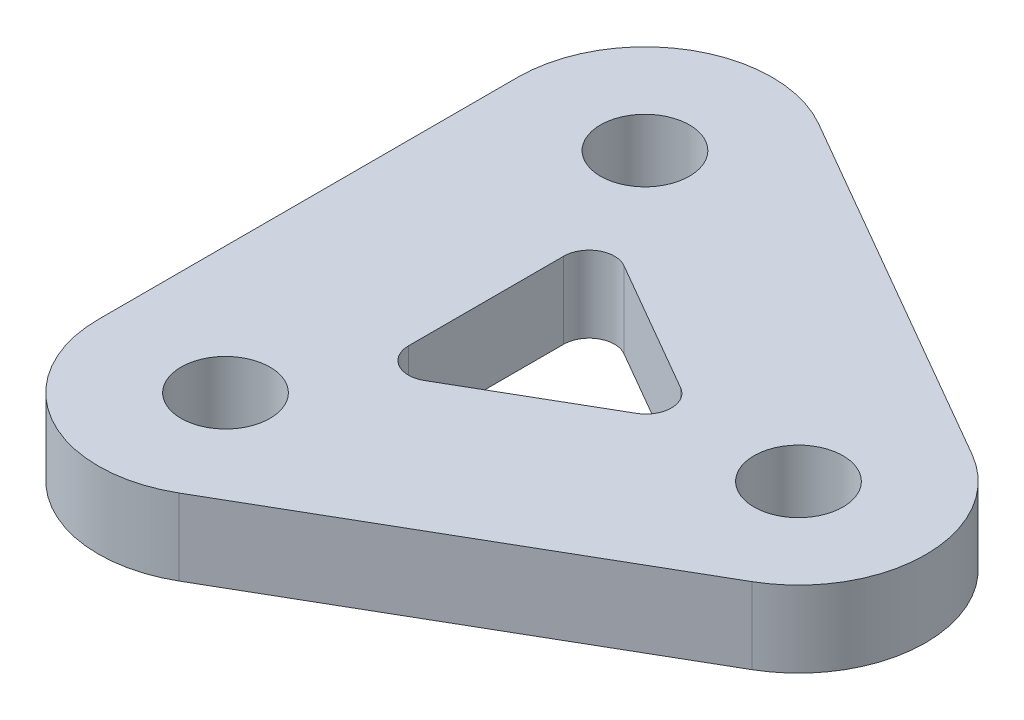
ISO-10303-21;
HEADER;
FILE_DESCRIPTION(('STEP AP214'),'2;1');
FILE_NAME('part.step','',(''),(''),'','','');
FILE_SCHEMA(('AUTOMOTIVE_DESIGN { 1 0 10303 214 1 1 1 1 }'));
ENDSEC;
DATA;
#1=APPLICATION_CONTEXT('core data for automotive mechanical design processes');
#2=APPLICATION_PROTOCOL_DEFINITION('international standard','automotive_design',2000,#1);
#3=PRODUCT_CONTEXT('',#1,'mechanical');
#4=PRODUCT('Part','Part','',(#3));
#5=PRODUCT_RELATED_PRODUCT_CATEGORY('part','',(#4));
#6=PRODUCT_DEFINITION_FORMATION('','',#4);
#7=PRODUCT_DEFINITION_CONTEXT('part definition',#1,'design');
#8=PRODUCT_DEFINITION('design','',#6,#7);
#9=PRODUCT_DEFINITION_SHAPE('','',#8);
#10=(LENGTH_UNIT() NAMED_UNIT(*) SI_UNIT(.MILLI.,.METRE.));
#11=(NAMED_UNIT(*) PLANE_ANGLE_UNIT() SI_UNIT($,.RADIAN.));
#12=(NAMED_UNIT(*) SI_UNIT($,.STERADIAN.) SOLID_ANGLE_UNIT());
#13=UNCERTAINTY_MEASURE_WITH_UNIT(LENGTH_MEASURE(1.E-05),#10,'distance_accuracy_value','');
#14=(GEOMETRIC_REPRESENTATION_CONTEXT(3) GLOBAL_UNCERTAINTY_ASSIGNED_CONTEXT((#13)) GLOBAL_UNIT_ASSIGNED_CONTEXT((#10,
#11,#12)) REPRESENTATION_CONTEXT('',''));
#15=CARTESIAN_POINT('',(0.,0.,0.));
#16=DIRECTION('',(0.,0.,1.));
#17=DIRECTION('',(1.,0.,0.));
#18=AXIS2_PLACEMENT_3D('',#15,#16,#17);
#19=CARTESIAN_POINT('',(-7.14470958122166,3.,-8.25000000000011));
#20=DIRECTION('',(0.,1.,0.));
#21=DIRECTION('',(0.,0.,1.));
#22=AXIS2_PLACEMENT_3D('',#19,#20,#21);
#23=PLANE('',#22);
#24=CARTESIAN_POINT('',(-7.14470958122166,3.,8.25000000000007));
#25=DIRECTION('',(0.,1.,0.));
#26=DIRECTION('',(0.,0.,1.));
#27=AXIS2_PLACEMENT_3D('',#24,#25,#26);
#28=CIRCLE('',#27,1.75);
#29=CARTESIAN_POINT('',(-7.14470958122166,3.,10.0000000000001));
#30=VERTEX_POINT('',#29);
#31=EDGE_CURVE('E181',#30,#30,#28,.T.);
#32=ORIENTED_EDGE('',*,*,#31,.F.);
#33=EDGE_LOOP('',(#32));
#34=FACE_BOUND('',#33,.T.);
#35=CARTESIAN_POINT('',(-7.14470958122166,3.,-8.25000000000011));
#36=DIRECTION('',(0.,1.,0.));
#37=DIRECTION('',(0.,0.,1.));
#38=AXIS2_PLACEMENT_3D('',#35,#36,#37);
#39=CIRCLE('',#38,5.);
#40=CARTESIAN_POINT('',(-4.6447095812216,3.,-12.5801270189223));
#41=VERTEX_POINT('',#40);
#42=CARTESIAN_POINT('',(-12.1447095812217,3.,-8.25000000000005));
#43=VERTEX_POINT('',#42);
#44=EDGE_CURVE('E193',#41,#43,#39,.T.);
#45=ORIENTED_EDGE('',*,*,#44,.T.);
#46=DIRECTION('',(0.,0.,1.));
#47=VECTOR('',#46,1.);
#48=CARTESIAN_POINT('',(-12.1447095812217,3.,-8.25000000000005));
#49=LINE('',#48,#47);
#50=CARTESIAN_POINT('',(-12.1447095812217,3.,8.25));
#51=VERTEX_POINT('',#50);
#52=EDGE_CURVE('E196',#43,#51,#49,.T.);
#53=ORIENTED_EDGE('',*,*,#52,.T.);
#54=CARTESIAN_POINT('',(-7.14470958122166,3.,8.25000000000007));
#55=DIRECTION('',(0.,1.,0.));
#56=DIRECTION('',(0.,0.,-1.));
#57=AXIS2_PLACEMENT_3D('',#54,#55,#56);
#58=CIRCLE('',#57,5.);
#59=CARTESIAN_POINT('',(-4.6447095812216,3.,12.5801270189222));
#60=VERTEX_POINT('',#59);
#61=EDGE_CURVE('E199',#51,#60,#58,.T.);
#62=ORIENTED_EDGE('',*,*,#61,.T.);
#63=DIRECTION('',(0.866025403784439,0.,-0.5));
#64=VECTOR('',#63,1.);
#65=CARTESIAN_POINT('',(-4.6447095812216,3.,12.5801270189222));
#66=LINE('',#65,#64);
#67=CARTESIAN_POINT('',(9.64470958122168,3.,4.3301270189222));
#68=VERTEX_POINT('',#67);
#69=EDGE_CURVE('E201',#60,#68,#66,.T.);
#70=ORIENTED_EDGE('',*,*,#69,.T.);
#71=CARTESIAN_POINT('',(7.14470958122174,3.,0.));
#72=DIRECTION('',(0.,1.,0.));
#73=DIRECTION('',(0.,0.,1.));
#74=AXIS2_PLACEMENT_3D('',#71,#72,#73);
#75=CIRCLE('',#74,5.);
#76=CARTESIAN_POINT('',(9.64470958122168,3.,-4.33012701892225));
#77=VERTEX_POINT('',#76);
#78=EDGE_CURVE('E203',#68,#77,#75,.T.);
#79=ORIENTED_EDGE('',*,*,#78,.T.);
#80=DIRECTION('',(-0.866025403784439,0.,-0.5));
#81=VECTOR('',#80,1.);
#82=CARTESIAN_POINT('',(9.64470958122168,3.,-4.33012701892225));
#83=LINE('',#82,#81);
#84=EDGE_CURVE('E205',#77,#41,#83,.T.);
#85=ORIENTED_EDGE('',*,*,#84,.T.);
#86=EDGE_LOOP('',(#45,#53,#62,#70,#79,#85));
#87=FACE_BOUND('',#86,.T.);
#88=CARTESIAN_POINT('',(7.14470958122166,3.,0.));
#89=DIRECTION('',(0.,1.,0.));
#90=DIRECTION('',(0.,0.,1.));
#91=AXIS2_PLACEMENT_3D('',#88,#89,#90);
#92=CIRCLE('',#91,1.75);
#93=CARTESIAN_POINT('',(7.14470958122166,3.,1.74999999999993));
#94=VERTEX_POINT('',#93);
#95=EDGE_CURVE('E187',#94,#94,#92,.T.);
#96=ORIENTED_EDGE('',*,*,#95,.F.);
#97=EDGE_LOOP('',(#96));
#98=FACE_BOUND('',#97,.T.);
#99=CARTESIAN_POINT('',(-7.14470958122166,3.,-8.24999999999993));
#100=DIRECTION('',(0.,1.,0.));
#101=DIRECTION('',(0.,0.,1.));
#102=AXIS2_PLACEMENT_3D('',#99,#100,#101);
#103=CIRCLE('',#102,1.75);
#104=CARTESIAN_POINT('',(-7.14470958122166,3.,-6.49999999999993));
#105=VERTEX_POINT('',#104);
#106=EDGE_CURVE('E175',#105,#105,#103,.T.);
#107=ORIENTED_EDGE('',*,*,#106,.F.);
#108=EDGE_LOOP('',(#107));
#109=FACE_BOUND('',#108,.T.);
#110=DIRECTION('',(-0.866025403784443,0.,-0.499999999999992));
#111=VECTOR('',#110,1.);
#112=CARTESIAN_POINT('',(1.64470958122163,3.,-0.866025403784468));
#113=LINE('',#112,#111);
#114=CARTESIAN_POINT('',(1.64470958122163,3.,-0.866025403784468));
#115=VERTEX_POINT('',#114);
#116=CARTESIAN_POINT('',(-3.64470958122167,3.,-3.9198729810778));
#117=VERTEX_POINT('',#116);
#118=EDGE_CURVE('E132',#115,#117,#113,.T.);
#119=ORIENTED_EDGE('',*,*,#118,.F.);
#120=CARTESIAN_POINT('',(1.14470958122164,3.,0.));
#121=DIRECTION('',(0.,1.,0.));
#122=DIRECTION('',(0.,0.,1.));
#123=AXIS2_PLACEMENT_3D('',#120,#121,#122);
#124=CIRCLE('',#123,1.);
#125=CARTESIAN_POINT('',(1.64470958122164,3.,0.866025403784412));
#126=VERTEX_POINT('',#125);
#127=EDGE_CURVE('E124',#126,#115,#124,.T.);
#128=ORIENTED_EDGE('',*,*,#127,.F.);
#129=DIRECTION('',(0.866025403784436,0.,-0.500000000000004));
#130=VECTOR('',#129,1.);
#131=CARTESIAN_POINT('',(-3.64470958122166,3.,3.91987298107785));
#132=LINE('',#131,#130);
#133=CARTESIAN_POINT('',(-3.64470958122166,3.,3.91987298107784));
#134=VERTEX_POINT('',#133);
#135=EDGE_CURVE('E153',#134,#126,#132,.T.);
#136=ORIENTED_EDGE('',*,*,#135,.F.);
#137=CARTESIAN_POINT('',(-4.14470958122166,3.,3.05384757729341));
#138=DIRECTION('',(0.,1.,0.));
#139=DIRECTION('',(0.,0.,1.));
#140=AXIS2_PLACEMENT_3D('',#137,#138,#139);
#141=CIRCLE('',#140,1.);
#142=CARTESIAN_POINT('',(-5.14470958122166,3.,3.05384757729341));
#143=VERTEX_POINT('',#142);
#144=EDGE_CURVE('E151',#143,#134,#141,.T.);
#145=ORIENTED_EDGE('',*,*,#144,.F.);
#146=DIRECTION('',(0.,0.,1.));
#147=VECTOR('',#146,1.);
#148=CARTESIAN_POINT('',(-5.14470958122166,3.,-3.05384757729336));
#149=LINE('',#148,#147);
#150=CARTESIAN_POINT('',(-5.14470958122166,3.,-3.05384757729336));
#151=VERTEX_POINT('',#150);
#152=EDGE_CURVE('E147',#151,#143,#149,.T.);
#153=ORIENTED_EDGE('',*,*,#152,.F.);
#154=CARTESIAN_POINT('',(-4.14470958122166,3.,-3.05384757729336));
#155=DIRECTION('',(0.,1.,0.));
#156=DIRECTION('',(0.,0.,-1.));
#157=AXIS2_PLACEMENT_3D('',#154,#155,#156);
#158=CIRCLE('',#157,1.);
#159=EDGE_CURVE('E145',#117,#151,#158,.T.);
#160=ORIENTED_EDGE('',*,*,#159,.F.);
#161=EDGE_LOOP('',(#119,#128,#136,#145,#153,#160));
#162=FACE_BOUND('',#161,.T.);
#163=ADVANCED_FACE('F35',(#34,#87,#98,#109,#162),#23,.T.);
#164=CARTESIAN_POINT('',(-7.14470958122166,0.,-8.25000000000011));
#165=DIRECTION('',(0.,1.,0.));
#166=DIRECTION('',(0.,0.,1.));
#167=AXIS2_PLACEMENT_3D('',#164,#165,#166);
#168=PLANE('',#167);
#169=CARTESIAN_POINT('',(-7.14470958122166,0.,-8.24999999999993));
#170=DIRECTION('',(0.,1.,0.));
#171=DIRECTION('',(0.,0.,1.));
#172=AXIS2_PLACEMENT_3D('',#169,#170,#171);
#173=CIRCLE('',#172,1.75);
#174=CARTESIAN_POINT('',(-7.14470958122166,0.,-6.49999999999993));
#175=VERTEX_POINT('',#174);
#176=EDGE_CURVE('E140',#175,#175,#173,.T.);
#177=ORIENTED_EDGE('',*,*,#176,.T.);
#178=EDGE_LOOP('',(#177));
#179=FACE_BOUND('',#178,.T.);
#180=CARTESIAN_POINT('',(-7.14470958122166,0.,8.25000000000007));
#181=DIRECTION('',(0.,1.,0.));
#182=DIRECTION('',(0.,0.,1.));
#183=AXIS2_PLACEMENT_3D('',#180,#181,#182);
#184=CIRCLE('',#183,1.75);
#185=CARTESIAN_POINT('',(-7.14470958122166,0.,10.0000000000001));
#186=VERTEX_POINT('',#185);
#187=EDGE_CURVE('E178',#186,#186,#184,.T.);
#188=ORIENTED_EDGE('',*,*,#187,.T.);
#189=EDGE_LOOP('',(#188));
#190=FACE_BOUND('',#189,.T.);
#191=CARTESIAN_POINT('',(7.14470958122166,0.,0.));
#192=DIRECTION('',(0.,1.,0.));
#193=DIRECTION('',(0.,0.,1.));
#194=AXIS2_PLACEMENT_3D('',#191,#192,#193);
#195=CIRCLE('',#194,1.75);
#196=CARTESIAN_POINT('',(7.14470958122166,0.,1.74999999999993));
#197=VERTEX_POINT('',#196);
#198=EDGE_CURVE('E184',#197,#197,#195,.T.);
#199=ORIENTED_EDGE('',*,*,#198,.T.);
#200=EDGE_LOOP('',(#199));
#201=FACE_BOUND('',#200,.T.);
#202=CARTESIAN_POINT('',(-7.14470958122166,0.,-8.25000000000011));
#203=DIRECTION('',(0.,1.,0.));
#204=DIRECTION('',(0.,0.,1.));
#205=AXIS2_PLACEMENT_3D('',#202,#203,#204);
#206=CIRCLE('',#205,5.);
#207=CARTESIAN_POINT('',(-4.6447095812216,0.,-12.5801270189223));
#208=VERTEX_POINT('',#207);
#209=CARTESIAN_POINT('',(-12.1447095812217,0.,-8.25000000000005));
#210=VERTEX_POINT('',#209);
#211=EDGE_CURVE('E190',#208,#210,#206,.T.);
#212=ORIENTED_EDGE('',*,*,#211,.F.);
#213=DIRECTION('',(-0.866025403784439,0.,-0.5));
#214=VECTOR('',#213,1.);
#215=CARTESIAN_POINT('',(9.64470958122168,0.,-4.33012701892225));
#216=LINE('',#215,#214);
#217=CARTESIAN_POINT('',(9.64470958122168,0.,-4.33012701892225));
#218=VERTEX_POINT('',#217);
#219=EDGE_CURVE('E197',#218,#208,#216,.T.);
#220=ORIENTED_EDGE('',*,*,#219,.F.);
#221=CARTESIAN_POINT('',(7.14470958122174,0.,0.));
#222=DIRECTION('',(0.,1.,0.));
#223=DIRECTION('',(0.,0.,1.));
#224=AXIS2_PLACEMENT_3D('',#221,#222,#223);
#225=CIRCLE('',#224,5.);
#226=CARTESIAN_POINT('',(9.64470958122168,0.,4.3301270189222));
#227=VERTEX_POINT('',#226);
#228=EDGE_CURVE('E216',#227,#218,#225,.T.);
#229=ORIENTED_EDGE('',*,*,#228,.F.);
#230=DIRECTION('',(0.866025403784439,0.,-0.5));
#231=VECTOR('',#230,1.);
#232=CARTESIAN_POINT('',(-4.6447095812216,0.,12.5801270189222));
#233=LINE('',#232,#231);
#234=CARTESIAN_POINT('',(-4.6447095812216,0.,12.5801270189222));
#235=VERTEX_POINT('',#234);
#236=EDGE_CURVE('E214',#235,#227,#233,.T.);
#237=ORIENTED_EDGE('',*,*,#236,.F.);
#238=CARTESIAN_POINT('',(-7.14470958122166,0.,8.25000000000007));
#239=DIRECTION('',(0.,1.,0.));
#240=DIRECTION('',(0.,0.,-1.));
#241=AXIS2_PLACEMENT_3D('',#238,#239,#240);
#242=CIRCLE('',#241,5.);
#243=CARTESIAN_POINT('',(-12.1447095812217,0.,8.25));
#244=VERTEX_POINT('',#243);
#245=EDGE_CURVE('E212',#244,#235,#242,.T.);
#246=ORIENTED_EDGE('',*,*,#245,.F.);
#247=DIRECTION('',(0.,0.,1.));
#248=VECTOR('',#247,1.);
#249=CARTESIAN_POINT('',(-12.1447095812217,0.,-8.25000000000005));
#250=LINE('',#249,#248);
#251=EDGE_CURVE('E210',#210,#244,#250,.T.);
#252=ORIENTED_EDGE('',*,*,#251,.F.);
#253=EDGE_LOOP('',(#212,#220,#229,#237,#246,#252));
#254=FACE_BOUND('',#253,.T.);
#255=CARTESIAN_POINT('',(1.14470958122164,0.,0.));
#256=DIRECTION('',(0.,1.,0.));
#257=DIRECTION('',(0.,0.,1.));
#258=AXIS2_PLACEMENT_3D('',#255,#256,#257);
#259=CIRCLE('',#258,1.);
#260=CARTESIAN_POINT('',(1.64470958122164,0.,0.866025403784408));
#261=VERTEX_POINT('',#260);
#262=CARTESIAN_POINT('',(1.64470958122163,0.,-0.866025403784468));
#263=VERTEX_POINT('',#262);
#264=EDGE_CURVE('E58',#261,#263,#259,.T.);
#265=ORIENTED_EDGE('',*,*,#264,.T.);
#266=DIRECTION('',(-0.866025403784443,0.,-0.499999999999992));
#267=VECTOR('',#266,1.);
#268=CARTESIAN_POINT('',(1.64470958122163,0.,-0.866025403784468));
#269=LINE('',#268,#267);
#270=CARTESIAN_POINT('',(-3.64470958122167,0.,-3.9198729810778));
#271=VERTEX_POINT('',#270);
#272=EDGE_CURVE('E139',#263,#271,#269,.T.);
#273=ORIENTED_EDGE('',*,*,#272,.T.);
#274=CARTESIAN_POINT('',(-4.14470958122166,0.,-3.05384757729336));
#275=DIRECTION('',(0.,1.,0.));
#276=DIRECTION('',(0.,0.,-1.));
#277=AXIS2_PLACEMENT_3D('',#274,#275,#276);
#278=CIRCLE('',#277,1.);
#279=CARTESIAN_POINT('',(-5.14470958122166,0.,-3.05384757729336));
#280=VERTEX_POINT('',#279);
#281=EDGE_CURVE('E157',#271,#280,#278,.T.);
#282=ORIENTED_EDGE('',*,*,#281,.T.);
#283=DIRECTION('',(0.,0.,1.));
#284=VECTOR('',#283,1.);
#285=CARTESIAN_POINT('',(-5.14470958122166,0.,-3.05384757729336));
#286=LINE('',#285,#284);
#287=CARTESIAN_POINT('',(-5.14470958122166,0.,3.05384757729341));
#288=VERTEX_POINT('',#287);
#289=EDGE_CURVE('E160',#280,#288,#286,.T.);
#290=ORIENTED_EDGE('',*,*,#289,.T.);
#291=CARTESIAN_POINT('',(-4.14470958122166,0.,3.05384757729341));
#292=DIRECTION('',(0.,1.,0.));
#293=DIRECTION('',(0.,0.,1.));
#294=AXIS2_PLACEMENT_3D('',#291,#292,#293);
#295=CIRCLE('',#294,1.);
#296=CARTESIAN_POINT('',(-3.64470958122166,0.,3.91987298107785));
#297=VERTEX_POINT('',#296);
#298=EDGE_CURVE('E163',#288,#297,#295,.T.);
#299=ORIENTED_EDGE('',*,*,#298,.T.);
#300=DIRECTION('',(0.866025403784436,0.,-0.500000000000004));
#301=VECTOR('',#300,1.);
#302=CARTESIAN_POINT('',(-3.64470958122166,0.,3.91987298107785));
#303=LINE('',#302,#301);
#304=EDGE_CURVE('E133',#297,#261,#303,.T.);
#305=ORIENTED_EDGE('',*,*,#304,.T.);
#306=EDGE_LOOP('',(#265,#273,#282,#290,#299,#305));
#307=FACE_BOUND('',#306,.T.);
#308=ADVANCED_FACE('F240',(#179,#190,#201,#254,#307),#168,.F.);
#309=CARTESIAN_POINT('',(-7.14470958122166,3.,-8.25000000000011));
#310=DIRECTION('',(0.,-1.,0.));
#311=DIRECTION('',(0.,0.,-1.));
#312=AXIS2_PLACEMENT_3D('',#309,#310,#311);
#313=CYLINDRICAL_SURFACE('',#312,5.);
#314=ORIENTED_EDGE('',*,*,#211,.T.);
#315=DIRECTION('',(0.,-1.,0.));
#316=VECTOR('',#315,1.);
#317=CARTESIAN_POINT('',(-12.1447095812217,3.,-8.25000000000005));
#318=LINE('',#317,#316);
#319=EDGE_CURVE('E11',#43,#210,#318,.T.);
#320=ORIENTED_EDGE('',*,*,#319,.F.);
#321=ORIENTED_EDGE('',*,*,#44,.F.);
#322=DIRECTION('',(0.,-1.,0.));
#323=VECTOR('',#322,1.);
#324=CARTESIAN_POINT('',(-4.6447095812216,3.,-12.5801270189223));
#325=LINE('',#324,#323);
#326=EDGE_CURVE('E207',#41,#208,#325,.T.);
#327=ORIENTED_EDGE('',*,*,#326,.T.);
#328=EDGE_LOOP('',(#314,#320,#321,#327));
#329=FACE_BOUND('',#328,.T.);
#330=ADVANCED_FACE('F37',(#329),#313,.T.);
#331=CARTESIAN_POINT('',(-12.1447095812217,3.,-8.25000000000005));
#332=DIRECTION('',(1.,0.,0.));
#333=DIRECTION('',(0.,0.,-1.));
#334=AXIS2_PLACEMENT_3D('',#331,#332,#333);
#335=PLANE('',#334);
#336=ORIENTED_EDGE('',*,*,#251,.T.);
#337=DIRECTION('',(0.,-1.,0.));
#338=VECTOR('',#337,1.);
#339=CARTESIAN_POINT('',(-12.1447095812217,3.,8.25));
#340=LINE('',#339,#338);
#341=EDGE_CURVE('E43',#51,#244,#340,.T.);
#342=ORIENTED_EDGE('',*,*,#341,.F.);
#343=ORIENTED_EDGE('',*,*,#52,.F.);
#344=ORIENTED_EDGE('',*,*,#319,.T.);
#345=EDGE_LOOP('',(#336,#342,#343,#344));
#346=FACE_BOUND('',#345,.T.);
#347=ADVANCED_FACE('F258',(#346),#335,.F.);
#348=CARTESIAN_POINT('',(-7.14470958122166,3.,8.25000000000007));
#349=DIRECTION('',(0.,-1.,0.));
#350=DIRECTION('',(0.,0.,-1.));
#351=AXIS2_PLACEMENT_3D('',#348,#349,#350);
#352=CYLINDRICAL_SURFACE('',#351,5.);
#353=ORIENTED_EDGE('',*,*,#245,.T.);
#354=DIRECTION('',(0.,-1.,0.));
#355=VECTOR('',#354,1.);
#356=CARTESIAN_POINT('',(-4.6447095812216,3.,12.5801270189222));
#357=LINE('',#356,#355);
#358=EDGE_CURVE('E227',#60,#235,#357,.T.);
#359=ORIENTED_EDGE('',*,*,#358,.F.);
#360=ORIENTED_EDGE('',*,*,#61,.F.);
#361=ORIENTED_EDGE('',*,*,#341,.T.);
#362=EDGE_LOOP('',(#353,#359,#360,#361));
#363=FACE_BOUND('',#362,.T.);
#364=ADVANCED_FACE('F234',(#363),#352,.T.);
#365=CARTESIAN_POINT('',(-4.6447095812216,3.,12.5801270189222));
#366=DIRECTION('',(-0.5,0.,-0.866025403784438));
#367=DIRECTION('',(-0.866025403784439,0.,0.5));
#368=AXIS2_PLACEMENT_3D('',#365,#366,#367);
#369=PLANE('',#368);
#370=ORIENTED_EDGE('',*,*,#236,.T.);
#371=DIRECTION('',(0.,-1.,0.));
#372=VECTOR('',#371,1.);
#373=CARTESIAN_POINT('',(9.64470958122168,3.,4.3301270189222));
#374=LINE('',#373,#372);
#375=EDGE_CURVE('E224',#68,#227,#374,.T.);
#376=ORIENTED_EDGE('',*,*,#375,.F.);
#377=ORIENTED_EDGE('',*,*,#69,.F.);
#378=ORIENTED_EDGE('',*,*,#358,.T.);
#379=EDGE_LOOP('',(#370,#376,#377,#378));
#380=FACE_BOUND('',#379,.T.);
#381=ADVANCED_FACE('F246',(#380),#369,.F.);
#382=CARTESIAN_POINT('',(7.14470958122174,3.,0.));
#383=DIRECTION('',(0.,-1.,0.));
#384=DIRECTION('',(0.,0.,-1.));
#385=AXIS2_PLACEMENT_3D('',#382,#383,#384);
#386=CYLINDRICAL_SURFACE('',#385,5.);
#387=ORIENTED_EDGE('',*,*,#228,.T.);
#388=DIRECTION('',(0.,-1.,0.));
#389=VECTOR('',#388,1.);
#390=CARTESIAN_POINT('',(9.64470958122168,3.,-4.33012701892225));
#391=LINE('',#390,#389);
#392=EDGE_CURVE('E221',#77,#218,#391,.T.);
#393=ORIENTED_EDGE('',*,*,#392,.F.);
#394=ORIENTED_EDGE('',*,*,#78,.F.);
#395=ORIENTED_EDGE('',*,*,#375,.T.);
#396=EDGE_LOOP('',(#387,#393,#394,#395));
#397=FACE_BOUND('',#396,.T.);
#398=ADVANCED_FACE('F250',(#397),#386,.T.);
#399=CARTESIAN_POINT('',(9.64470958122168,3.,-4.33012701892225));
#400=DIRECTION('',(-0.5,0.,0.866025403784438));
#401=DIRECTION('',(0.866025403784439,0.,0.5));
#402=AXIS2_PLACEMENT_3D('',#399,#400,#401);
#403=PLANE('',#402);
#404=ORIENTED_EDGE('',*,*,#219,.T.);
#405=ORIENTED_EDGE('',*,*,#326,.F.);
#406=ORIENTED_EDGE('',*,*,#84,.F.);
#407=ORIENTED_EDGE('',*,*,#392,.T.);
#408=EDGE_LOOP('',(#404,#405,#406,#407));
#409=FACE_BOUND('',#408,.T.);
#410=ADVANCED_FACE('F261',(#409),#403,.F.);
#411=CARTESIAN_POINT('',(7.14470958122166,3.,0.));
#412=DIRECTION('',(0.,-1.,0.));
#413=DIRECTION('',(0.,0.,-1.));
#414=AXIS2_PLACEMENT_3D('',#411,#412,#413);
#415=CYLINDRICAL_SURFACE('',#414,1.75);
#416=ORIENTED_EDGE('',*,*,#95,.T.);
#417=EDGE_LOOP('',(#416));
#418=FACE_BOUND('',#417,.T.);
#419=ORIENTED_EDGE('',*,*,#198,.F.);
#420=EDGE_LOOP('',(#419));
#421=FACE_BOUND('',#420,.T.);
#422=ADVANCED_FACE('F263',(#418,#421),#415,.F.);
#423=CARTESIAN_POINT('',(-7.14470958122166,3.,8.25000000000007));
#424=DIRECTION('',(0.,-1.,0.));
#425=DIRECTION('',(0.,0.,-1.));
#426=AXIS2_PLACEMENT_3D('',#423,#424,#425);
#427=CYLINDRICAL_SURFACE('',#426,1.75);
#428=ORIENTED_EDGE('',*,*,#31,.T.);
#429=EDGE_LOOP('',(#428));
#430=FACE_BOUND('',#429,.T.);
#431=ORIENTED_EDGE('',*,*,#187,.F.);
#432=EDGE_LOOP('',(#431));
#433=FACE_BOUND('',#432,.T.);
#434=ADVANCED_FACE('F269',(#430,#433),#427,.F.);
#435=CARTESIAN_POINT('',(-7.14470958122166,3.,-8.24999999999993));
#436=DIRECTION('',(0.,-1.,0.));
#437=DIRECTION('',(0.,0.,-1.));
#438=AXIS2_PLACEMENT_3D('',#435,#436,#437);
#439=CYLINDRICAL_SURFACE('',#438,1.75);
#440=ORIENTED_EDGE('',*,*,#106,.T.);
#441=EDGE_LOOP('',(#440));
#442=FACE_BOUND('',#441,.T.);
#443=ORIENTED_EDGE('',*,*,#176,.F.);
#444=EDGE_LOOP('',(#443));
#445=FACE_BOUND('',#444,.T.);
#446=ADVANCED_FACE('F285',(#442,#445),#439,.F.);
#447=CARTESIAN_POINT('',(1.14470958122164,3.,0.));
#448=DIRECTION('',(0.,-1.,0.));
#449=DIRECTION('',(0.,0.,-1.));
#450=AXIS2_PLACEMENT_3D('',#447,#448,#449);
#451=CYLINDRICAL_SURFACE('',#450,1.);
#452=ORIENTED_EDGE('',*,*,#264,.F.);
#453=DIRECTION('',(0.,-1.,0.));
#454=VECTOR('',#453,1.);
#455=CARTESIAN_POINT('',(1.64470958122164,3.,0.866025403784412));
#456=LINE('',#455,#454);
#457=EDGE_CURVE('E128',#126,#261,#456,.T.);
#458=ORIENTED_EDGE('',*,*,#457,.F.);
#459=ORIENTED_EDGE('',*,*,#127,.T.);
#460=DIRECTION('',(0.,-1.,0.));
#461=VECTOR('',#460,1.);
#462=CARTESIAN_POINT('',(1.64470958122163,3.,-0.866025403784468));
#463=LINE('',#462,#461);
#464=EDGE_CURVE('E127',#115,#263,#463,.T.);
#465=ORIENTED_EDGE('',*,*,#464,.T.);
#466=EDGE_LOOP('',(#452,#458,#459,#465));
#467=FACE_BOUND('',#466,.T.);
#468=ADVANCED_FACE('F126',(#467),#451,.F.);
#469=CARTESIAN_POINT('',(1.64470958122163,3.,-0.866025403784468));
#470=DIRECTION('',(-0.499999999999992,0.,0.866025403784443));
#471=DIRECTION('',(0.866025403784443,0.,0.499999999999992));
#472=AXIS2_PLACEMENT_3D('',#469,#470,#471);
#473=PLANE('',#472);
#474=ORIENTED_EDGE('',*,*,#272,.F.);
#475=ORIENTED_EDGE('',*,*,#464,.F.);
#476=ORIENTED_EDGE('',*,*,#118,.T.);
#477=DIRECTION('',(0.,-1.,0.));
#478=VECTOR('',#477,1.);
#479=CARTESIAN_POINT('',(-3.64470958122167,3.,-3.9198729810778));
#480=LINE('',#479,#478);
#481=EDGE_CURVE('E141',#117,#271,#480,.T.);
#482=ORIENTED_EDGE('',*,*,#481,.T.);
#483=EDGE_LOOP('',(#474,#475,#476,#482));
#484=FACE_BOUND('',#483,.T.);
#485=ADVANCED_FACE('F136',(#484),#473,.T.);
#486=CARTESIAN_POINT('',(-4.14470958122166,3.,-3.05384757729336));
#487=DIRECTION('',(0.,-1.,0.));
#488=DIRECTION('',(0.,0.,-1.));
#489=AXIS2_PLACEMENT_3D('',#486,#487,#488);
#490=CYLINDRICAL_SURFACE('',#489,1.);
#491=ORIENTED_EDGE('',*,*,#281,.F.);
#492=ORIENTED_EDGE('',*,*,#481,.F.);
#493=ORIENTED_EDGE('',*,*,#159,.T.);
#494=DIRECTION('',(0.,-1.,0.));
#495=VECTOR('',#494,1.);
#496=CARTESIAN_POINT('',(-5.14470958122166,3.,-3.05384757729336));
#497=LINE('',#496,#495);
#498=EDGE_CURVE('E172',#151,#280,#497,.T.);
#499=ORIENTED_EDGE('',*,*,#498,.T.);
#500=EDGE_LOOP('',(#491,#492,#493,#499));
#501=FACE_BOUND('',#500,.T.);
#502=ADVANCED_FACE('F294',(#501),#490,.F.);
#503=CARTESIAN_POINT('',(-5.14470958122166,3.,-3.05384757729336));
#504=DIRECTION('',(1.,0.,0.));
#505=DIRECTION('',(0.,0.,-1.));
#506=AXIS2_PLACEMENT_3D('',#503,#504,#505);
#507=PLANE('',#506);
#508=ORIENTED_EDGE('',*,*,#289,.F.);
#509=ORIENTED_EDGE('',*,*,#498,.F.);
#510=ORIENTED_EDGE('',*,*,#152,.T.);
#511=DIRECTION('',(0.,-1.,0.));
#512=VECTOR('',#511,1.);
#513=CARTESIAN_POINT('',(-5.14470958122166,3.,3.05384757729341));
#514=LINE('',#513,#512);
#515=EDGE_CURVE('E170',#143,#288,#514,.T.);
#516=ORIENTED_EDGE('',*,*,#515,.T.);
#517=EDGE_LOOP('',(#508,#509,#510,#516));
#518=FACE_BOUND('',#517,.T.);
#519=ADVANCED_FACE('F297',(#518),#507,.T.);
#520=CARTESIAN_POINT('',(-4.14470958122166,3.,3.05384757729341));
#521=DIRECTION('',(0.,-1.,0.));
#522=DIRECTION('',(0.,0.,-1.));
#523=AXIS2_PLACEMENT_3D('',#520,#521,#522);
#524=CYLINDRICAL_SURFACE('',#523,1.);
#525=ORIENTED_EDGE('',*,*,#298,.F.);
#526=ORIENTED_EDGE('',*,*,#515,.F.);
#527=ORIENTED_EDGE('',*,*,#144,.T.);
#528=DIRECTION('',(0.,-1.,0.));
#529=VECTOR('',#528,1.);
#530=CARTESIAN_POINT('',(-3.64470958122166,3.,3.91987298107785));
#531=LINE('',#530,#529);
#532=EDGE_CURVE('E50',#134,#297,#531,.T.);
#533=ORIENTED_EDGE('',*,*,#532,.T.);
#534=EDGE_LOOP('',(#525,#526,#527,#533));
#535=FACE_BOUND('',#534,.T.);
#536=ADVANCED_FACE('F301',(#535),#524,.F.);
#537=CARTESIAN_POINT('',(-3.64470958122166,3.,3.91987298107785));
#538=DIRECTION('',(-0.500000000000004,0.,-0.866025403784436));
#539=DIRECTION('',(-0.866025403784436,0.,0.500000000000004));
#540=AXIS2_PLACEMENT_3D('',#537,#538,#539);
#541=PLANE('',#540);
#542=ORIENTED_EDGE('',*,*,#304,.F.);
#543=ORIENTED_EDGE('',*,*,#532,.F.);
#544=ORIENTED_EDGE('',*,*,#135,.T.);
#545=ORIENTED_EDGE('',*,*,#457,.T.);
#546=EDGE_LOOP('',(#542,#543,#544,#545));
#547=FACE_BOUND('',#546,.T.);
#548=ADVANCED_FACE('F305',(#547),#541,.T.);
#549=CLOSED_SHELL('',(#163,#308,#330,#347,#364,#381,#398,#410,#422,#434,#446,#468,#485,#502,
#519,#536,#548));
#550=MANIFOLD_SOLID_BREP('B2',#549);
#551=ADVANCED_BREP_SHAPE_REPRESENTATION('',(#18,#550),#14);
#552=SHAPE_DEFINITION_REPRESENTATION(#9,#551);
ENDSEC;
END-ISO-10303-21;
